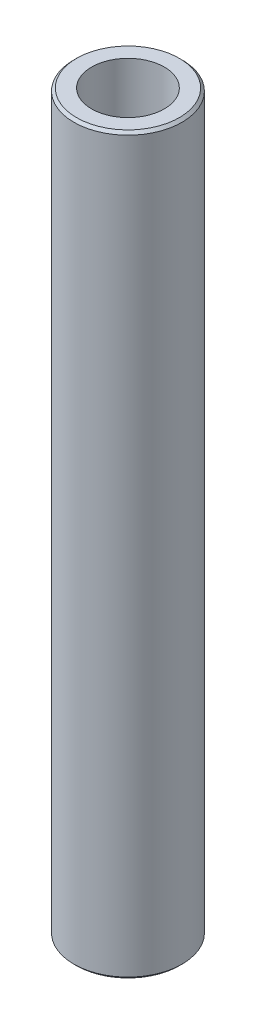
ISO-10303-21;
HEADER;
FILE_DESCRIPTION(('STEP AP214'),'2;1');
FILE_NAME('part.step','',(''),(''),'','','');
FILE_SCHEMA(('AUTOMOTIVE_DESIGN { 1 0 10303 214 1 1 1 1 }'));
ENDSEC;
DATA;
#1=APPLICATION_CONTEXT('core data for automotive mechanical design processes');
#2=APPLICATION_PROTOCOL_DEFINITION('international standard','automotive_design',2000,#1);
#3=PRODUCT_CONTEXT('',#1,'mechanical');
#4=PRODUCT('Part','Part','',(#3));
#5=PRODUCT_RELATED_PRODUCT_CATEGORY('part','',(#4));
#6=PRODUCT_DEFINITION_FORMATION('','',#4);
#7=PRODUCT_DEFINITION_CONTEXT('part definition',#1,'design');
#8=PRODUCT_DEFINITION('design','',#6,#7);
#9=PRODUCT_DEFINITION_SHAPE('','',#8);
#10=(LENGTH_UNIT() NAMED_UNIT(*) SI_UNIT(.MILLI.,.METRE.));
#11=(NAMED_UNIT(*) PLANE_ANGLE_UNIT() SI_UNIT($,.RADIAN.));
#12=(NAMED_UNIT(*) SI_UNIT($,.STERADIAN.) SOLID_ANGLE_UNIT());
#13=UNCERTAINTY_MEASURE_WITH_UNIT(LENGTH_MEASURE(1.E-05),#10,'distance_accuracy_value','');
#14=(GEOMETRIC_REPRESENTATION_CONTEXT(3) GLOBAL_UNCERTAINTY_ASSIGNED_CONTEXT((#13)) GLOBAL_UNIT_ASSIGNED_CONTEXT((#10,
#11,#12)) REPRESENTATION_CONTEXT('',''));
#15=CARTESIAN_POINT('',(0.,0.,0.));
#16=DIRECTION('',(0.,0.,1.));
#17=DIRECTION('',(1.,0.,0.));
#18=AXIS2_PLACEMENT_3D('',#15,#16,#17);
#19=CARTESIAN_POINT('',(0.,237.653496643424,0.));
#20=DIRECTION('',(0.,-1.,0.));
#21=DIRECTION('',(0.,0.,-1.));
#22=AXIS2_PLACEMENT_3D('',#19,#20,#21);
#23=CYLINDRICAL_SURFACE('',#22,17.5);
#24=CARTESIAN_POINT('',(0.,236.784952960619,0.));
#25=DIRECTION('',(0.,1.,0.));
#26=DIRECTION('',(0.,0.,1.));
#27=AXIS2_PLACEMENT_3D('',#24,#25,#26);
#28=CIRCLE('',#27,17.5);
#29=CARTESIAN_POINT('',(0.,236.784952960619,17.5));
#30=VERTEX_POINT('',#29);
#31=EDGE_CURVE('E50',#30,#30,#28,.F.);
#32=ORIENTED_EDGE('',*,*,#31,.T.);
#33=EDGE_LOOP('',(#32));
#34=FACE_BOUND('',#33,.T.);
#35=CARTESIAN_POINT('',(0.,0.868543682805006,0.));
#36=DIRECTION('',(0.,1.,0.));
#37=DIRECTION('',(0.,0.,1.));
#38=AXIS2_PLACEMENT_3D('',#35,#36,#37);
#39=CIRCLE('',#38,17.5);
#40=CARTESIAN_POINT('',(0.,0.868543682805006,17.5));
#41=VERTEX_POINT('',#40);
#42=EDGE_CURVE('E51',#41,#41,#39,.T.);
#43=ORIENTED_EDGE('',*,*,#42,.T.);
#44=EDGE_LOOP('',(#43));
#45=FACE_BOUND('',#44,.T.);
#46=ADVANCED_FACE('F39',(#34,#45),#23,.T.);
#47=CARTESIAN_POINT('',(0.,237.653496643424,0.));
#48=DIRECTION('',(0.,1.,0.));
#49=DIRECTION('',(0.,0.,1.));
#50=AXIS2_PLACEMENT_3D('',#47,#48,#49);
#51=PLANE('',#50);
#52=CARTESIAN_POINT('',(0.,237.653496643424,0.));
#53=DIRECTION('',(0.,1.,0.));
#54=DIRECTION('',(0.,0.,1.));
#55=AXIS2_PLACEMENT_3D('',#52,#53,#54);
#56=CIRCLE('',#55,16.6314563171949);
#57=CARTESIAN_POINT('',(0.,237.653496643424,16.6314563171949));
#58=VERTEX_POINT('',#57);
#59=EDGE_CURVE('E54',#58,#58,#56,.T.);
#60=ORIENTED_EDGE('',*,*,#59,.T.);
#61=EDGE_LOOP('',(#60));
#62=FACE_BOUND('',#61,.T.);
#63=CARTESIAN_POINT('',(0.,237.653496643424,0.));
#64=DIRECTION('',(0.,1.,0.));
#65=DIRECTION('',(0.,0.,1.));
#66=AXIS2_PLACEMENT_3D('',#63,#64,#65);
#67=CIRCLE('',#66,11.7616112260441);
#68=CARTESIAN_POINT('',(0.,237.653496643424,11.7616112260441));
#69=VERTEX_POINT('',#68);
#70=EDGE_CURVE('E58',#69,#69,#67,.T.);
#71=ORIENTED_EDGE('',*,*,#70,.F.);
#72=EDGE_LOOP('',(#71));
#73=FACE_BOUND('',#72,.T.);
#74=ADVANCED_FACE('F69',(#62,#73),#51,.T.);
#75=CARTESIAN_POINT('',(0.,0.,0.));
#76=DIRECTION('',(0.,1.,0.));
#77=DIRECTION('',(0.,0.,1.));
#78=AXIS2_PLACEMENT_3D('',#75,#76,#77);
#79=PLANE('',#78);
#80=CARTESIAN_POINT('',(0.,0.,0.));
#81=DIRECTION('',(0.,1.,0.));
#82=DIRECTION('',(0.,0.,1.));
#83=AXIS2_PLACEMENT_3D('',#80,#81,#82);
#84=CIRCLE('',#83,16.631456317195);
#85=CARTESIAN_POINT('',(0.,0.,16.631456317195));
#86=VERTEX_POINT('',#85);
#87=EDGE_CURVE('E10',#86,#86,#84,.F.);
#88=ORIENTED_EDGE('',*,*,#87,.T.);
#89=EDGE_LOOP('',(#88));
#90=FACE_BOUND('',#89,.T.);
#91=CARTESIAN_POINT('',(0.,0.,0.));
#92=DIRECTION('',(0.,1.,0.));
#93=DIRECTION('',(0.,0.,1.));
#94=AXIS2_PLACEMENT_3D('',#91,#92,#93);
#95=CIRCLE('',#94,11.7616112260441);
#96=CARTESIAN_POINT('',(0.,0.,11.7616112260441));
#97=VERTEX_POINT('',#96);
#98=EDGE_CURVE('E63',#97,#97,#95,.T.);
#99=ORIENTED_EDGE('',*,*,#98,.T.);
#100=EDGE_LOOP('',(#99));
#101=FACE_BOUND('',#100,.T.);
#102=ADVANCED_FACE('F75',(#90,#101),#79,.F.);
#103=CARTESIAN_POINT('',(0.,237.653496643424,0.));
#104=DIRECTION('',(0.,-1.,0.));
#105=DIRECTION('',(0.,0.,-1.));
#106=AXIS2_PLACEMENT_3D('',#103,#104,#105);
#107=CYLINDRICAL_SURFACE('',#106,11.7616112260441);
#108=ORIENTED_EDGE('',*,*,#70,.T.);
#109=EDGE_LOOP('',(#108));
#110=FACE_BOUND('',#109,.T.);
#111=ORIENTED_EDGE('',*,*,#98,.F.);
#112=EDGE_LOOP('',(#111));
#113=FACE_BOUND('',#112,.T.);
#114=ADVANCED_FACE('F70',(#110,#113),#107,.F.);
#115=CARTESIAN_POINT('',(0.,237.653496643424,0.));
#116=DIRECTION('',(0.,-1.,0.));
#117=DIRECTION('',(0.,0.,-1.));
#118=AXIS2_PLACEMENT_3D('',#115,#116,#117);
#119=CONICAL_SURFACE('',#118,16.6314563171949,0.785398163397426);
#120=ORIENTED_EDGE('',*,*,#31,.F.);
#121=EDGE_LOOP('',(#120));
#122=FACE_BOUND('',#121,.T.);
#123=ORIENTED_EDGE('',*,*,#59,.F.);
#124=EDGE_LOOP('',(#123));
#125=FACE_BOUND('',#124,.T.);
#126=ADVANCED_FACE('F81',(#122,#125),#119,.T.);
#127=CARTESIAN_POINT('',(0.,0.868543682805006,0.));
#128=DIRECTION('',(0.,1.,0.));
#129=DIRECTION('',(0.,0.,1.));
#130=AXIS2_PLACEMENT_3D('',#127,#128,#129);
#131=CONICAL_SURFACE('',#130,17.5,0.785398163397458);
#132=ORIENTED_EDGE('',*,*,#87,.F.);
#133=EDGE_LOOP('',(#132));
#134=FACE_BOUND('',#133,.T.);
#135=ORIENTED_EDGE('',*,*,#42,.F.);
#136=EDGE_LOOP('',(#135));
#137=FACE_BOUND('',#136,.T.);
#138=ADVANCED_FACE('F45',(#134,#137),#131,.T.);
#139=CLOSED_SHELL('',(#46,#74,#102,#114,#126,#138));
#140=MANIFOLD_SOLID_BREP('B2',#139);
#141=ADVANCED_BREP_SHAPE_REPRESENTATION('',(#18,#140),#14);
#142=SHAPE_DEFINITION_REPRESENTATION(#9,#141);
ENDSEC;
END-ISO-10303-21;
